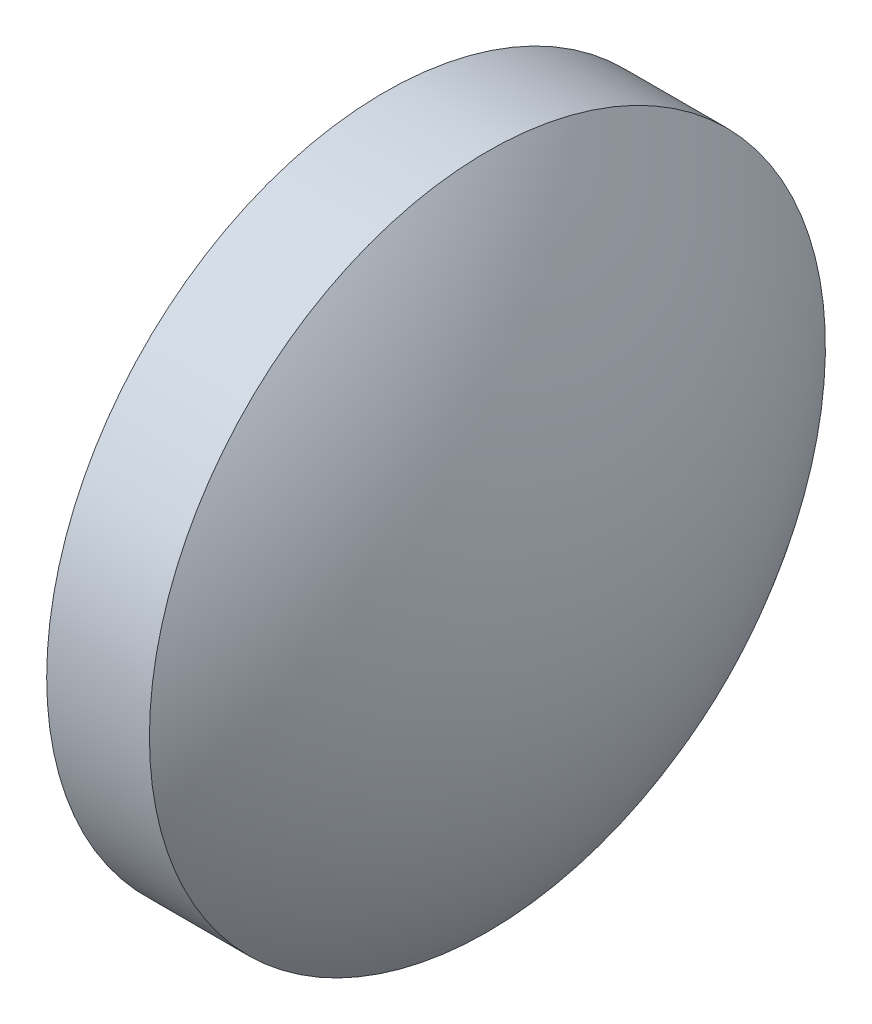
ISO-10303-21;
HEADER;
FILE_DESCRIPTION(('STEP AP214'),'2;1');
FILE_NAME('part.step','',(''),(''),'','','');
FILE_SCHEMA(('AUTOMOTIVE_DESIGN { 1 0 10303 214 1 1 1 1 }'));
ENDSEC;
DATA;
#1=APPLICATION_CONTEXT('core data for automotive mechanical design processes');
#2=APPLICATION_PROTOCOL_DEFINITION('international standard','automotive_design',2000,#1);
#3=PRODUCT_CONTEXT('',#1,'mechanical');
#4=PRODUCT('Part','Part','',(#3));
#5=PRODUCT_RELATED_PRODUCT_CATEGORY('part','',(#4));
#6=PRODUCT_DEFINITION_FORMATION('','',#4);
#7=PRODUCT_DEFINITION_CONTEXT('part definition',#1,'design');
#8=PRODUCT_DEFINITION('design','',#6,#7);
#9=PRODUCT_DEFINITION_SHAPE('','',#8);
#10=(LENGTH_UNIT() NAMED_UNIT(*) SI_UNIT(.MILLI.,.METRE.));
#11=(NAMED_UNIT(*) PLANE_ANGLE_UNIT() SI_UNIT($,.RADIAN.));
#12=(NAMED_UNIT(*) SI_UNIT($,.STERADIAN.) SOLID_ANGLE_UNIT());
#13=UNCERTAINTY_MEASURE_WITH_UNIT(LENGTH_MEASURE(1.E-05),#10,'distance_accuracy_value','');
#14=(GEOMETRIC_REPRESENTATION_CONTEXT(3) GLOBAL_UNCERTAINTY_ASSIGNED_CONTEXT((#13)) GLOBAL_UNIT_ASSIGNED_CONTEXT((#10,
#11,#12)) REPRESENTATION_CONTEXT('',''));
#15=CARTESIAN_POINT('',(0.,0.,0.));
#16=DIRECTION('',(0.,0.,1.));
#17=DIRECTION('',(1.,0.,0.));
#18=AXIS2_PLACEMENT_3D('',#15,#16,#17);
#19=CARTESIAN_POINT('',(517.925172062054,17.0546151633082,0.));
#20=DIRECTION('',(-1.,0.,0.));
#21=DIRECTION('',(0.,-1.,0.));
#22=AXIS2_PLACEMENT_3D('',#19,#20,#21);
#23=SPHERICAL_SURFACE('',#22,8.28047619047621);
#24=CARTESIAN_POINT('',(524.525648252531,17.0546151633081,0.));
#25=DIRECTION('',(-1.,0.,0.));
#26=DIRECTION('',(0.,0.,1.));
#27=AXIS2_PLACEMENT_3D('',#24,#25,#26);
#28=CIRCLE('',#27,5.);
#29=CARTESIAN_POINT('',(524.525648252531,17.0546151633081,5.));
#30=VERTEX_POINT('',#29);
#31=EDGE_CURVE('E10',#30,#30,#28,.T.);
#32=ORIENTED_EDGE('',*,*,#31,.F.);
#33=EDGE_LOOP('',(#32));
#34=FACE_BOUND('',#33,.T.);
#35=ADVANCED_FACE('F35',(#34),#23,.T.);
#36=CARTESIAN_POINT('',(522.207975998465,17.0546151633081,0.));
#37=DIRECTION('',(-1.,0.,0.));
#38=DIRECTION('',(0.,0.,1.));
#39=AXIS2_PLACEMENT_3D('',#36,#37,#38);
#40=CYLINDRICAL_SURFACE('',#39,5.);
#41=CARTESIAN_POINT('',(523.005648252531,17.0546151633081,0.));
#42=DIRECTION('',(-1.,0.,0.));
#43=DIRECTION('',(0.,0.,1.));
#44=AXIS2_PLACEMENT_3D('',#41,#42,#43);
#45=CIRCLE('',#44,5.);
#46=CARTESIAN_POINT('',(523.005648252531,17.0546151633081,5.));
#47=VERTEX_POINT('',#46);
#48=EDGE_CURVE('E41',#47,#47,#45,.T.);
#49=ORIENTED_EDGE('',*,*,#48,.F.);
#50=EDGE_LOOP('',(#49));
#51=FACE_BOUND('',#50,.T.);
#52=ORIENTED_EDGE('',*,*,#31,.T.);
#53=EDGE_LOOP('',(#52));
#54=FACE_BOUND('',#53,.T.);
#55=ADVANCED_FACE('F49',(#51,#54),#40,.T.);
#56=CARTESIAN_POINT('',(523.005648252531,17.0546151633081,0.));
#57=DIRECTION('',(1.,0.,0.));
#58=DIRECTION('',(0.,0.,-1.));
#59=AXIS2_PLACEMENT_3D('',#56,#57,#58);
#60=PLANE('',#59);
#61=ORIENTED_EDGE('',*,*,#48,.T.);
#62=EDGE_LOOP('',(#61));
#63=FACE_BOUND('',#62,.T.);
#64=ADVANCED_FACE('F47',(#63),#60,.F.);
#65=CLOSED_SHELL('',(#35,#55,#64));
#66=MANIFOLD_SOLID_BREP('B2',#65);
#67=ADVANCED_BREP_SHAPE_REPRESENTATION('',(#18,#66),#14);
#68=SHAPE_DEFINITION_REPRESENTATION(#9,#67);
ENDSEC;
END-ISO-10303-21;
